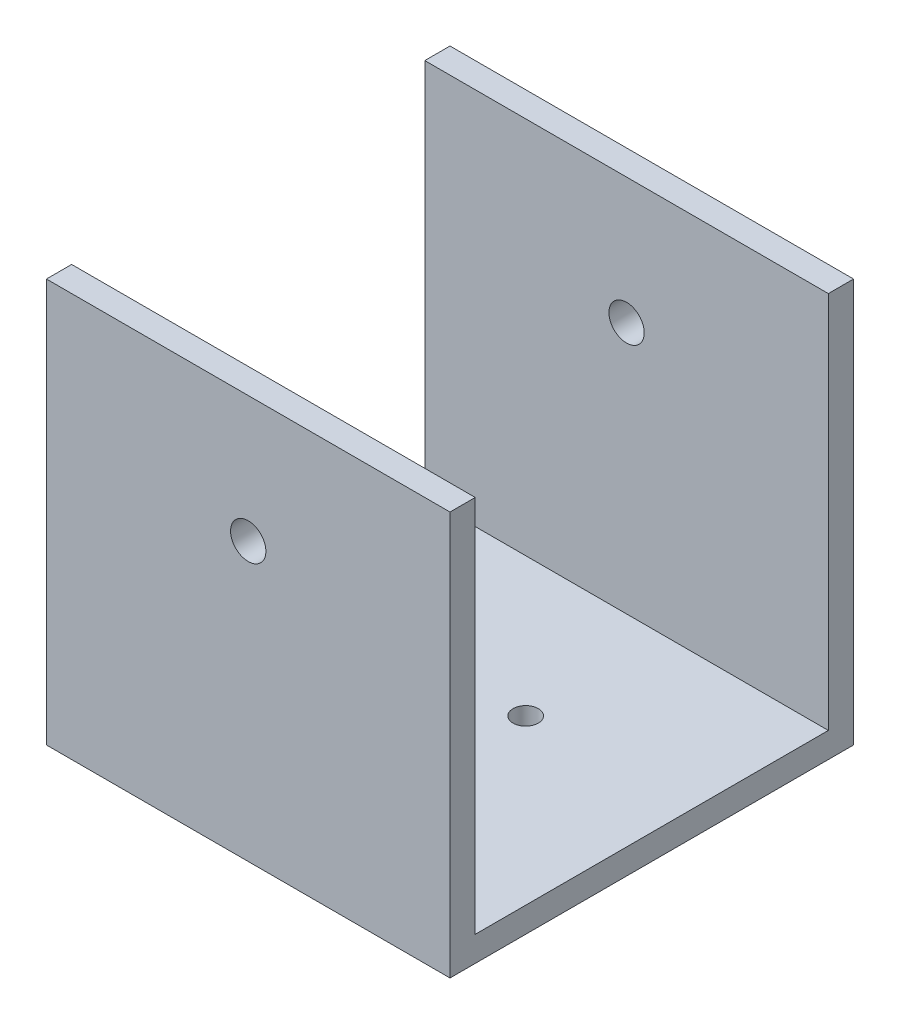
ISO-10303-21;
HEADER;
FILE_DESCRIPTION(('STEP AP214'),'2;1');
FILE_NAME('part.step','',(''),(''),'','','');
FILE_SCHEMA(('AUTOMOTIVE_DESIGN { 1 0 10303 214 1 1 1 1 }'));
ENDSEC;
DATA;
#1=APPLICATION_CONTEXT('core data for automotive mechanical design processes');
#2=APPLICATION_PROTOCOL_DEFINITION('international standard','automotive_design',2000,#1);
#3=PRODUCT_CONTEXT('',#1,'mechanical');
#4=PRODUCT('Part','Part','',(#3));
#5=PRODUCT_RELATED_PRODUCT_CATEGORY('part','',(#4));
#6=PRODUCT_DEFINITION_FORMATION('','',#4);
#7=PRODUCT_DEFINITION_CONTEXT('part definition',#1,'design');
#8=PRODUCT_DEFINITION('design','',#6,#7);
#9=PRODUCT_DEFINITION_SHAPE('','',#8);
#10=(LENGTH_UNIT() NAMED_UNIT(*) SI_UNIT(.MILLI.,.METRE.));
#11=(NAMED_UNIT(*) PLANE_ANGLE_UNIT() SI_UNIT($,.RADIAN.));
#12=(NAMED_UNIT(*) SI_UNIT($,.STERADIAN.) SOLID_ANGLE_UNIT());
#13=UNCERTAINTY_MEASURE_WITH_UNIT(LENGTH_MEASURE(1.E-05),#10,'distance_accuracy_value','');
#14=(GEOMETRIC_REPRESENTATION_CONTEXT(3) GLOBAL_UNCERTAINTY_ASSIGNED_CONTEXT((#13)) GLOBAL_UNIT_ASSIGNED_CONTEXT((#10,
#11,#12)) REPRESENTATION_CONTEXT('',''));
#15=CARTESIAN_POINT('',(0.,0.,0.));
#16=DIRECTION('',(0.,0.,1.));
#17=DIRECTION('',(1.,0.,0.));
#18=AXIS2_PLACEMENT_3D('',#15,#16,#17);
#19=CARTESIAN_POINT('',(-40.,40.,80.));
#20=DIRECTION('',(0.,-1.,0.));
#21=DIRECTION('',(0.,0.,-1.));
#22=AXIS2_PLACEMENT_3D('',#19,#20,#21);
#23=PLANE('',#22);
#24=DIRECTION('',(0.,0.,-1.));
#25=VECTOR('',#24,1.);
#26=CARTESIAN_POINT('',(-40.,40.,80.));
#27=LINE('',#26,#25);
#28=CARTESIAN_POINT('',(-40.,40.,5.));
#29=VERTEX_POINT('',#28);
#30=CARTESIAN_POINT('',(-40.,40.,0.));
#31=VERTEX_POINT('',#30);
#32=EDGE_CURVE('E142',#29,#31,#27,.T.);
#33=ORIENTED_EDGE('',*,*,#32,.F.);
#34=DIRECTION('',(1.,0.,0.));
#35=VECTOR('',#34,1.);
#36=CARTESIAN_POINT('',(-40.,40.,5.));
#37=LINE('',#36,#35);
#38=CARTESIAN_POINT('',(40.,40.,5.));
#39=VERTEX_POINT('',#38);
#40=EDGE_CURVE('E155',#29,#39,#37,.T.);
#41=ORIENTED_EDGE('',*,*,#40,.T.);
#42=DIRECTION('',(0.,0.,-1.));
#43=VECTOR('',#42,1.);
#44=CARTESIAN_POINT('',(40.,40.,80.));
#45=LINE('',#44,#43);
#46=CARTESIAN_POINT('',(40.,40.,0.));
#47=VERTEX_POINT('',#46);
#48=EDGE_CURVE('E53',#39,#47,#45,.T.);
#49=ORIENTED_EDGE('',*,*,#48,.T.);
#50=DIRECTION('',(-1.,0.,0.));
#51=VECTOR('',#50,1.);
#52=CARTESIAN_POINT('',(-40.,40.,0.));
#53=LINE('',#52,#51);
#54=EDGE_CURVE('E219',#47,#31,#53,.T.);
#55=ORIENTED_EDGE('',*,*,#54,.T.);
#56=EDGE_LOOP('',(#33,#41,#49,#55));
#57=FACE_BOUND('',#56,.T.);
#58=ADVANCED_FACE('F43',(#57),#23,.F.);
#59=CARTESIAN_POINT('',(0.,15.,80.));
#60=DIRECTION('',(0.,0.,-1.));
#61=DIRECTION('',(-1.,0.,0.));
#62=AXIS2_PLACEMENT_3D('',#59,#60,#61);
#63=CYLINDRICAL_SURFACE('',#62,3.5);
#64=CARTESIAN_POINT('',(0.,15.,5.));
#65=DIRECTION('',(0.,0.,-1.));
#66=DIRECTION('',(-1.,0.,0.));
#67=AXIS2_PLACEMENT_3D('',#64,#65,#66);
#68=CIRCLE('',#67,3.5);
#69=CARTESIAN_POINT('',(-3.5,15.,5.));
#70=VERTEX_POINT('',#69);
#71=EDGE_CURVE('E154',#70,#70,#68,.T.);
#72=ORIENTED_EDGE('',*,*,#71,.F.);
#73=EDGE_LOOP('',(#72));
#74=FACE_BOUND('',#73,.T.);
#75=CARTESIAN_POINT('',(0.,15.,0.));
#76=DIRECTION('',(0.,0.,1.));
#77=DIRECTION('',(1.,0.,0.));
#78=AXIS2_PLACEMENT_3D('',#75,#76,#77);
#79=CIRCLE('',#78,3.5);
#80=CARTESIAN_POINT('',(3.49999999999999,15.,0.));
#81=VERTEX_POINT('',#80);
#82=EDGE_CURVE('E159',#81,#81,#79,.T.);
#83=ORIENTED_EDGE('',*,*,#82,.F.);
#84=EDGE_LOOP('',(#83));
#85=FACE_BOUND('',#84,.T.);
#86=ADVANCED_FACE('F287',(#74,#85),#63,.F.);
#87=CARTESIAN_POINT('',(0.,0.,80.));
#88=DIRECTION('',(0.,0.,1.));
#89=DIRECTION('',(1.,0.,0.));
#90=AXIS2_PLACEMENT_3D('',#87,#88,#89);
#91=PLANE('',#90);
#92=DIRECTION('',(0.,1.,0.));
#93=VECTOR('',#92,1.);
#94=CARTESIAN_POINT('',(40.,40.,80.));
#95=LINE('',#94,#93);
#96=CARTESIAN_POINT('',(40.,-40.,80.));
#97=VERTEX_POINT('',#96);
#98=CARTESIAN_POINT('',(40.,40.,80.));
#99=VERTEX_POINT('',#98);
#100=EDGE_CURVE('E206',#97,#99,#95,.T.);
#101=ORIENTED_EDGE('',*,*,#100,.T.);
#102=DIRECTION('',(-1.,0.,0.));
#103=VECTOR('',#102,1.);
#104=CARTESIAN_POINT('',(-40.,40.,80.));
#105=LINE('',#104,#103);
#106=CARTESIAN_POINT('',(-40.,40.,80.));
#107=VERTEX_POINT('',#106);
#108=EDGE_CURVE('E98',#99,#107,#105,.T.);
#109=ORIENTED_EDGE('',*,*,#108,.T.);
#110=DIRECTION('',(0.,-1.,0.));
#111=VECTOR('',#110,1.);
#112=CARTESIAN_POINT('',(-40.,40.,80.));
#113=LINE('',#112,#111);
#114=CARTESIAN_POINT('',(-40.,-40.,80.));
#115=VERTEX_POINT('',#114);
#116=EDGE_CURVE('E140',#107,#115,#113,.T.);
#117=ORIENTED_EDGE('',*,*,#116,.T.);
#118=DIRECTION('',(1.,0.,0.));
#119=VECTOR('',#118,1.);
#120=CARTESIAN_POINT('',(-40.,-40.,80.));
#121=LINE('',#120,#119);
#122=EDGE_CURVE('E70',#115,#97,#121,.T.);
#123=ORIENTED_EDGE('',*,*,#122,.T.);
#124=EDGE_LOOP('',(#101,#109,#117,#123));
#125=FACE_BOUND('',#124,.T.);
#126=CARTESIAN_POINT('',(0.,15.,80.));
#127=DIRECTION('',(0.,0.,1.));
#128=DIRECTION('',(1.,0.,0.));
#129=AXIS2_PLACEMENT_3D('',#126,#127,#128);
#130=CIRCLE('',#129,3.5);
#131=CARTESIAN_POINT('',(3.49999999999999,15.,80.));
#132=VERTEX_POINT('',#131);
#133=EDGE_CURVE('E198',#132,#132,#130,.T.);
#134=ORIENTED_EDGE('',*,*,#133,.F.);
#135=EDGE_LOOP('',(#134));
#136=FACE_BOUND('',#135,.T.);
#137=ADVANCED_FACE('F284',(#125,#136),#91,.T.);
#138=CARTESIAN_POINT('',(0.,0.,0.));
#139=DIRECTION('',(0.,0.,1.));
#140=DIRECTION('',(1.,0.,0.));
#141=AXIS2_PLACEMENT_3D('',#138,#139,#140);
#142=PLANE('',#141);
#143=DIRECTION('',(0.,1.,0.));
#144=VECTOR('',#143,1.);
#145=CARTESIAN_POINT('',(40.,40.,0.));
#146=LINE('',#145,#144);
#147=CARTESIAN_POINT('',(40.,-40.,0.));
#148=VERTEX_POINT('',#147);
#149=EDGE_CURVE('E202',#148,#47,#146,.T.);
#150=ORIENTED_EDGE('',*,*,#149,.F.);
#151=DIRECTION('',(1.,0.,0.));
#152=VECTOR('',#151,1.);
#153=CARTESIAN_POINT('',(-40.,-40.,0.));
#154=LINE('',#153,#152);
#155=CARTESIAN_POINT('',(-40.,-40.,0.));
#156=VERTEX_POINT('',#155);
#157=EDGE_CURVE('E91',#156,#148,#154,.T.);
#158=ORIENTED_EDGE('',*,*,#157,.F.);
#159=DIRECTION('',(0.,-1.,0.));
#160=VECTOR('',#159,1.);
#161=CARTESIAN_POINT('',(-40.,40.,0.));
#162=LINE('',#161,#160);
#163=EDGE_CURVE('E223',#31,#156,#162,.T.);
#164=ORIENTED_EDGE('',*,*,#163,.F.);
#165=ORIENTED_EDGE('',*,*,#54,.F.);
#166=EDGE_LOOP('',(#150,#158,#164,#165));
#167=FACE_BOUND('',#166,.T.);
#168=ORIENTED_EDGE('',*,*,#82,.T.);
#169=EDGE_LOOP('',(#168));
#170=FACE_BOUND('',#169,.T.);
#171=ADVANCED_FACE('F235',(#167,#170),#142,.F.);
#172=CARTESIAN_POINT('',(40.,40.,80.));
#173=DIRECTION('',(-1.,0.,0.));
#174=DIRECTION('',(0.,-1.,0.));
#175=AXIS2_PLACEMENT_3D('',#172,#173,#174);
#176=PLANE('',#175);
#177=ORIENTED_EDGE('',*,*,#48,.F.);
#178=DIRECTION('',(0.,1.,0.));
#179=VECTOR('',#178,1.);
#180=CARTESIAN_POINT('',(40.,-35.,5.));
#181=LINE('',#180,#179);
#182=CARTESIAN_POINT('',(40.,-35.,5.));
#183=VERTEX_POINT('',#182);
#184=EDGE_CURVE('E129',#183,#39,#181,.T.);
#185=ORIENTED_EDGE('',*,*,#184,.F.);
#186=DIRECTION('',(0.,0.,-1.));
#187=VECTOR('',#186,1.);
#188=CARTESIAN_POINT('',(40.,-35.,75.));
#189=LINE('',#188,#187);
#190=CARTESIAN_POINT('',(40.,-35.,75.));
#191=VERTEX_POINT('',#190);
#192=EDGE_CURVE('E179',#191,#183,#189,.T.);
#193=ORIENTED_EDGE('',*,*,#192,.F.);
#194=DIRECTION('',(0.,-1.,0.));
#195=VECTOR('',#194,1.);
#196=CARTESIAN_POINT('',(40.,40.,75.));
#197=LINE('',#196,#195);
#198=CARTESIAN_POINT('',(40.,40.,75.));
#199=VERTEX_POINT('',#198);
#200=EDGE_CURVE('E175',#199,#191,#197,.T.);
#201=ORIENTED_EDGE('',*,*,#200,.F.);
#202=EDGE_CURVE('E11',#99,#199,#45,.T.);
#203=ORIENTED_EDGE('',*,*,#202,.F.);
#204=ORIENTED_EDGE('',*,*,#100,.F.);
#205=DIRECTION('',(0.,0.,-1.));
#206=VECTOR('',#205,1.);
#207=CARTESIAN_POINT('',(40.,-40.,80.));
#208=LINE('',#207,#206);
#209=EDGE_CURVE('E215',#97,#148,#208,.T.);
#210=ORIENTED_EDGE('',*,*,#209,.T.);
#211=ORIENTED_EDGE('',*,*,#149,.T.);
#212=EDGE_LOOP('',(#177,#185,#193,#201,#203,#204,#210,#211));
#213=FACE_BOUND('',#212,.T.);
#214=ADVANCED_FACE('F45',(#213),#176,.F.);
#215=ORIENTED_EDGE('',*,*,#202,.T.);
#216=DIRECTION('',(1.,0.,0.));
#217=VECTOR('',#216,1.);
#218=CARTESIAN_POINT('',(-40.,40.,75.));
#219=LINE('',#218,#217);
#220=CARTESIAN_POINT('',(-40.,40.,75.));
#221=VERTEX_POINT('',#220);
#222=EDGE_CURVE('E123',#221,#199,#219,.T.);
#223=ORIENTED_EDGE('',*,*,#222,.F.);
#224=EDGE_CURVE('E132',#107,#221,#27,.T.);
#225=ORIENTED_EDGE('',*,*,#224,.F.);
#226=ORIENTED_EDGE('',*,*,#108,.F.);
#227=EDGE_LOOP('',(#215,#223,#225,#226));
#228=FACE_BOUND('',#227,.T.);
#229=ADVANCED_FACE('F131',(#228),#23,.F.);
#230=CARTESIAN_POINT('',(-40.,40.,80.));
#231=DIRECTION('',(1.,0.,0.));
#232=DIRECTION('',(0.,1.,0.));
#233=AXIS2_PLACEMENT_3D('',#230,#231,#232);
#234=PLANE('',#233);
#235=DIRECTION('',(0.,0.,-1.));
#236=VECTOR('',#235,1.);
#237=CARTESIAN_POINT('',(-40.,-35.,75.));
#238=LINE('',#237,#236);
#239=CARTESIAN_POINT('',(-40.,-35.,75.));
#240=VERTEX_POINT('',#239);
#241=CARTESIAN_POINT('',(-40.,-35.,5.));
#242=VERTEX_POINT('',#241);
#243=EDGE_CURVE('E61',#240,#242,#238,.T.);
#244=ORIENTED_EDGE('',*,*,#243,.T.);
#245=DIRECTION('',(0.,1.,0.));
#246=VECTOR('',#245,1.);
#247=CARTESIAN_POINT('',(-40.,-35.,5.));
#248=LINE('',#247,#246);
#249=EDGE_CURVE('E136',#242,#29,#248,.T.);
#250=ORIENTED_EDGE('',*,*,#249,.T.);
#251=ORIENTED_EDGE('',*,*,#32,.T.);
#252=ORIENTED_EDGE('',*,*,#163,.T.);
#253=DIRECTION('',(0.,0.,-1.));
#254=VECTOR('',#253,1.);
#255=CARTESIAN_POINT('',(-40.,-40.,80.));
#256=LINE('',#255,#254);
#257=EDGE_CURVE('E146',#115,#156,#256,.T.);
#258=ORIENTED_EDGE('',*,*,#257,.F.);
#259=ORIENTED_EDGE('',*,*,#116,.F.);
#260=ORIENTED_EDGE('',*,*,#224,.T.);
#261=DIRECTION('',(0.,-1.,0.));
#262=VECTOR('',#261,1.);
#263=CARTESIAN_POINT('',(-40.,40.,75.));
#264=LINE('',#263,#262);
#265=EDGE_CURVE('E119',#221,#240,#264,.T.);
#266=ORIENTED_EDGE('',*,*,#265,.T.);
#267=EDGE_LOOP('',(#244,#250,#251,#252,#258,#259,#260,#266));
#268=FACE_BOUND('',#267,.T.);
#269=ADVANCED_FACE('F138',(#268),#234,.F.);
#270=CARTESIAN_POINT('',(-40.,-40.,80.));
#271=DIRECTION('',(0.,1.,0.));
#272=DIRECTION('',(0.,0.,1.));
#273=AXIS2_PLACEMENT_3D('',#270,#271,#272);
#274=PLANE('',#273);
#275=CARTESIAN_POINT('',(-27.4999999999996,-40.,32.5));
#276=DIRECTION('',(0.,-1.,0.));
#277=DIRECTION('',(0.,0.,-1.));
#278=AXIS2_PLACEMENT_3D('',#275,#276,#277);
#279=CIRCLE('',#278,2.5);
#280=CARTESIAN_POINT('',(-27.4999999999996,-40.,30.));
#281=VERTEX_POINT('',#280);
#282=EDGE_CURVE('E253',#281,#281,#279,.T.);
#283=ORIENTED_EDGE('',*,*,#282,.F.);
#284=EDGE_LOOP('',(#283));
#285=FACE_BOUND('',#284,.T.);
#286=CARTESIAN_POINT('',(7.50000000000038,-40.,32.5));
#287=DIRECTION('',(0.,-1.,0.));
#288=DIRECTION('',(0.,0.,-1.));
#289=AXIS2_PLACEMENT_3D('',#286,#287,#288);
#290=CIRCLE('',#289,2.5);
#291=CARTESIAN_POINT('',(7.50000000000038,-40.,30.));
#292=VERTEX_POINT('',#291);
#293=EDGE_CURVE('E257',#292,#292,#290,.T.);
#294=ORIENTED_EDGE('',*,*,#293,.F.);
#295=EDGE_LOOP('',(#294));
#296=FACE_BOUND('',#295,.T.);
#297=CARTESIAN_POINT('',(7.50000000000001,-40.,67.5));
#298=DIRECTION('',(0.,-1.,0.));
#299=DIRECTION('',(0.,0.,-1.));
#300=AXIS2_PLACEMENT_3D('',#297,#298,#299);
#301=CIRCLE('',#300,2.5);
#302=CARTESIAN_POINT('',(7.50000000000001,-40.,65.));
#303=VERTEX_POINT('',#302);
#304=EDGE_CURVE('E252',#303,#303,#301,.T.);
#305=ORIENTED_EDGE('',*,*,#304,.F.);
#306=EDGE_LOOP('',(#305));
#307=FACE_BOUND('',#306,.T.);
#308=CARTESIAN_POINT('',(-27.5,-40.,67.5));
#309=DIRECTION('',(0.,-1.,0.));
#310=DIRECTION('',(0.,0.,-1.));
#311=AXIS2_PLACEMENT_3D('',#308,#309,#310);
#312=CIRCLE('',#311,2.5);
#313=CARTESIAN_POINT('',(-27.5,-40.,65.));
#314=VERTEX_POINT('',#313);
#315=EDGE_CURVE('E165',#314,#314,#312,.T.);
#316=ORIENTED_EDGE('',*,*,#315,.F.);
#317=EDGE_LOOP('',(#316));
#318=FACE_BOUND('',#317,.T.);
#319=ORIENTED_EDGE('',*,*,#157,.T.);
#320=ORIENTED_EDGE('',*,*,#209,.F.);
#321=ORIENTED_EDGE('',*,*,#122,.F.);
#322=ORIENTED_EDGE('',*,*,#257,.T.);
#323=EDGE_LOOP('',(#319,#320,#321,#322));
#324=FACE_BOUND('',#323,.T.);
#325=ADVANCED_FACE('F232',(#285,#296,#307,#318,#324),#274,.F.);
#326=CARTESIAN_POINT('',(0.,15.,75.));
#327=DIRECTION('',(0.,0.,1.));
#328=DIRECTION('',(1.,0.,0.));
#329=AXIS2_PLACEMENT_3D('',#326,#327,#328);
#330=CIRCLE('',#329,3.5);
#331=CARTESIAN_POINT('',(3.49999999999999,15.,75.));
#332=VERTEX_POINT('',#331);
#333=EDGE_CURVE('E150',#332,#332,#330,.T.);
#334=ORIENTED_EDGE('',*,*,#333,.F.);
#335=EDGE_LOOP('',(#334));
#336=FACE_BOUND('',#335,.T.);
#337=ORIENTED_EDGE('',*,*,#133,.T.);
#338=EDGE_LOOP('',(#337));
#339=FACE_BOUND('',#338,.T.);
#340=ADVANCED_FACE('F270',(#336,#339),#63,.F.);
#341=CARTESIAN_POINT('',(-40.,-35.,5.));
#342=DIRECTION('',(0.,0.,-1.));
#343=DIRECTION('',(-1.,0.,0.));
#344=AXIS2_PLACEMENT_3D('',#341,#342,#343);
#345=PLANE('',#344);
#346=ORIENTED_EDGE('',*,*,#71,.T.);
#347=EDGE_LOOP('',(#346));
#348=FACE_BOUND('',#347,.T.);
#349=ORIENTED_EDGE('',*,*,#184,.T.);
#350=ORIENTED_EDGE('',*,*,#40,.F.);
#351=ORIENTED_EDGE('',*,*,#249,.F.);
#352=DIRECTION('',(1.,0.,0.));
#353=VECTOR('',#352,1.);
#354=CARTESIAN_POINT('',(-40.,-35.,5.));
#355=LINE('',#354,#353);
#356=EDGE_CURVE('E193',#242,#183,#355,.T.);
#357=ORIENTED_EDGE('',*,*,#356,.T.);
#358=EDGE_LOOP('',(#349,#350,#351,#357));
#359=FACE_BOUND('',#358,.T.);
#360=ADVANCED_FACE('F245',(#348,#359),#345,.F.);
#361=CARTESIAN_POINT('',(-40.,-35.,75.));
#362=DIRECTION('',(0.,-1.,0.));
#363=DIRECTION('',(1.,0.,0.));
#364=AXIS2_PLACEMENT_3D('',#361,#362,#363);
#365=PLANE('',#364);
#366=CARTESIAN_POINT('',(-27.4999999999996,-35.,32.5));
#367=DIRECTION('',(0.,-1.,0.));
#368=DIRECTION('',(1.,0.,0.));
#369=AXIS2_PLACEMENT_3D('',#366,#367,#368);
#370=CIRCLE('',#369,2.5);
#371=CARTESIAN_POINT('',(-24.9999999999996,-35.,32.5));
#372=VERTEX_POINT('',#371);
#373=EDGE_CURVE('E47',#372,#372,#370,.T.);
#374=ORIENTED_EDGE('',*,*,#373,.T.);
#375=EDGE_LOOP('',(#374));
#376=FACE_BOUND('',#375,.T.);
#377=CARTESIAN_POINT('',(7.50000000000038,-35.,32.5));
#378=DIRECTION('',(0.,-1.,0.));
#379=DIRECTION('',(1.,0.,0.));
#380=AXIS2_PLACEMENT_3D('',#377,#378,#379);
#381=CIRCLE('',#380,2.5);
#382=CARTESIAN_POINT('',(10.0000000000004,-35.,32.5));
#383=VERTEX_POINT('',#382);
#384=EDGE_CURVE('E168',#383,#383,#381,.T.);
#385=ORIENTED_EDGE('',*,*,#384,.T.);
#386=EDGE_LOOP('',(#385));
#387=FACE_BOUND('',#386,.T.);
#388=CARTESIAN_POINT('',(7.50000000000001,-35.,67.5));
#389=DIRECTION('',(0.,-1.,0.));
#390=DIRECTION('',(1.,0.,0.));
#391=AXIS2_PLACEMENT_3D('',#388,#389,#390);
#392=CIRCLE('',#391,2.5);
#393=CARTESIAN_POINT('',(10.,-35.,67.5));
#394=VERTEX_POINT('',#393);
#395=EDGE_CURVE('E164',#394,#394,#392,.T.);
#396=ORIENTED_EDGE('',*,*,#395,.T.);
#397=EDGE_LOOP('',(#396));
#398=FACE_BOUND('',#397,.T.);
#399=CARTESIAN_POINT('',(-27.5,-35.,67.5));
#400=DIRECTION('',(0.,-1.,0.));
#401=DIRECTION('',(1.,0.,0.));
#402=AXIS2_PLACEMENT_3D('',#399,#400,#401);
#403=CIRCLE('',#402,2.5);
#404=CARTESIAN_POINT('',(-25.,-35.,67.5));
#405=VERTEX_POINT('',#404);
#406=EDGE_CURVE('E160',#405,#405,#403,.T.);
#407=ORIENTED_EDGE('',*,*,#406,.T.);
#408=EDGE_LOOP('',(#407));
#409=FACE_BOUND('',#408,.T.);
#410=ORIENTED_EDGE('',*,*,#192,.T.);
#411=ORIENTED_EDGE('',*,*,#356,.F.);
#412=ORIENTED_EDGE('',*,*,#243,.F.);
#413=DIRECTION('',(1.,0.,0.));
#414=VECTOR('',#413,1.);
#415=CARTESIAN_POINT('',(-40.,-35.,75.));
#416=LINE('',#415,#414);
#417=EDGE_CURVE('E125',#240,#191,#416,.T.);
#418=ORIENTED_EDGE('',*,*,#417,.T.);
#419=EDGE_LOOP('',(#410,#411,#412,#418));
#420=FACE_BOUND('',#419,.T.);
#421=ADVANCED_FACE('F281',(#376,#387,#398,#409,#420),#365,.F.);
#422=CARTESIAN_POINT('',(-40.,40.,75.));
#423=DIRECTION('',(0.,0.,1.));
#424=DIRECTION('',(1.,0.,0.));
#425=AXIS2_PLACEMENT_3D('',#422,#423,#424);
#426=PLANE('',#425);
#427=ORIENTED_EDGE('',*,*,#333,.T.);
#428=EDGE_LOOP('',(#427));
#429=FACE_BOUND('',#428,.T.);
#430=ORIENTED_EDGE('',*,*,#200,.T.);
#431=ORIENTED_EDGE('',*,*,#417,.F.);
#432=ORIENTED_EDGE('',*,*,#265,.F.);
#433=ORIENTED_EDGE('',*,*,#222,.T.);
#434=EDGE_LOOP('',(#430,#431,#432,#433));
#435=FACE_BOUND('',#434,.T.);
#436=ADVANCED_FACE('F122',(#429,#435),#426,.F.);
#437=CARTESIAN_POINT('',(-27.5,20.,67.5));
#438=DIRECTION('',(0.,-1.,0.));
#439=DIRECTION('',(0.,0.,-1.));
#440=AXIS2_PLACEMENT_3D('',#437,#438,#439);
#441=CYLINDRICAL_SURFACE('',#440,2.5);
#442=ORIENTED_EDGE('',*,*,#315,.T.);
#443=EDGE_LOOP('',(#442));
#444=FACE_BOUND('',#443,.T.);
#445=ORIENTED_EDGE('',*,*,#406,.F.);
#446=EDGE_LOOP('',(#445));
#447=FACE_BOUND('',#446,.T.);
#448=ADVANCED_FACE('F275',(#444,#447),#441,.F.);
#449=CARTESIAN_POINT('',(7.50000000000001,20.,67.5));
#450=DIRECTION('',(0.,-1.,0.));
#451=DIRECTION('',(0.,0.,-1.));
#452=AXIS2_PLACEMENT_3D('',#449,#450,#451);
#453=CYLINDRICAL_SURFACE('',#452,2.5);
#454=ORIENTED_EDGE('',*,*,#304,.T.);
#455=EDGE_LOOP('',(#454));
#456=FACE_BOUND('',#455,.T.);
#457=ORIENTED_EDGE('',*,*,#395,.F.);
#458=EDGE_LOOP('',(#457));
#459=FACE_BOUND('',#458,.T.);
#460=ADVANCED_FACE('F265',(#456,#459),#453,.F.);
#461=CARTESIAN_POINT('',(7.50000000000038,20.,32.5));
#462=DIRECTION('',(0.,-1.,0.));
#463=DIRECTION('',(0.,0.,-1.));
#464=AXIS2_PLACEMENT_3D('',#461,#462,#463);
#465=CYLINDRICAL_SURFACE('',#464,2.5);
#466=ORIENTED_EDGE('',*,*,#293,.T.);
#467=EDGE_LOOP('',(#466));
#468=FACE_BOUND('',#467,.T.);
#469=ORIENTED_EDGE('',*,*,#384,.F.);
#470=EDGE_LOOP('',(#469));
#471=FACE_BOUND('',#470,.T.);
#472=ADVANCED_FACE('F397',(#468,#471),#465,.F.);
#473=CARTESIAN_POINT('',(-27.4999999999996,20.,32.5));
#474=DIRECTION('',(0.,-1.,0.));
#475=DIRECTION('',(0.,0.,-1.));
#476=AXIS2_PLACEMENT_3D('',#473,#474,#475);
#477=CYLINDRICAL_SURFACE('',#476,2.5);
#478=ORIENTED_EDGE('',*,*,#282,.T.);
#479=EDGE_LOOP('',(#478));
#480=FACE_BOUND('',#479,.T.);
#481=ORIENTED_EDGE('',*,*,#373,.F.);
#482=EDGE_LOOP('',(#481));
#483=FACE_BOUND('',#482,.T.);
#484=ADVANCED_FACE('F407',(#480,#483),#477,.F.);
#485=CLOSED_SHELL('',(#58,#86,#137,#171,#214,#229,#269,#325,#340,#360,#421,#436,#448,#460,#472,#484));
#486=MANIFOLD_SOLID_BREP('B2',#485);
#487=ADVANCED_BREP_SHAPE_REPRESENTATION('',(#18,#486),#14);
#488=SHAPE_DEFINITION_REPRESENTATION(#9,#487);
ENDSEC;
END-ISO-10303-21;
